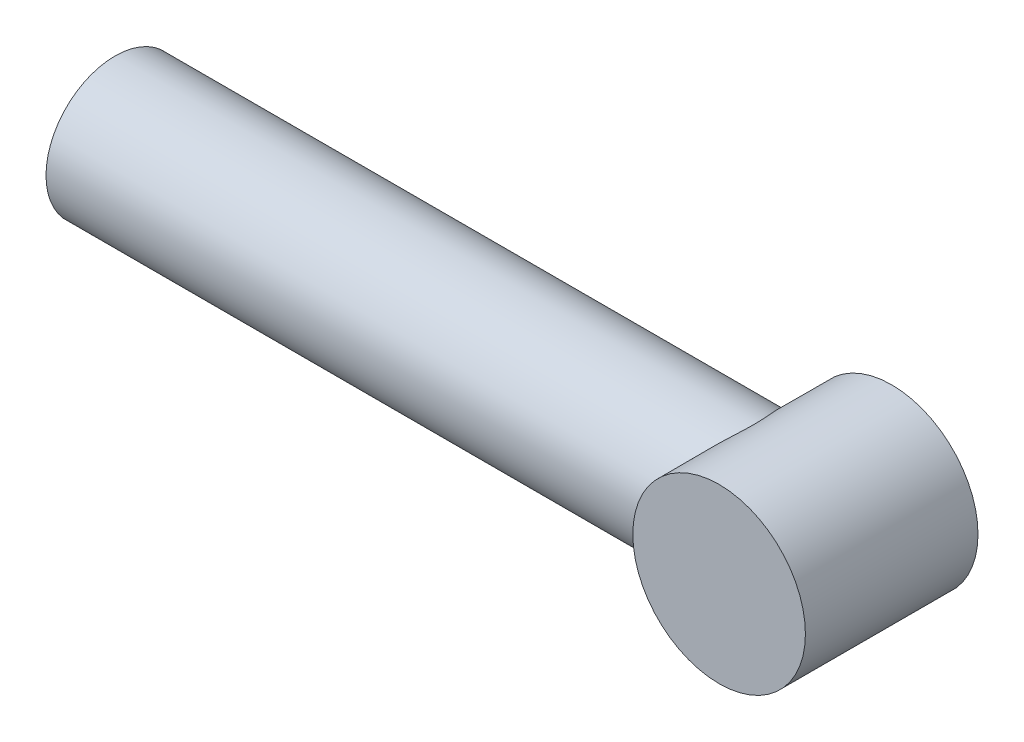
ISO-10303-21;
HEADER;
FILE_DESCRIPTION(('STEP AP214'),'2;1');
FILE_NAME('part.step','',(''),(''),'','','');
FILE_SCHEMA(('AUTOMOTIVE_DESIGN { 1 0 10303 214 1 1 1 1 }'));
ENDSEC;
DATA;
#1=APPLICATION_CONTEXT('core data for automotive mechanical design processes');
#2=APPLICATION_PROTOCOL_DEFINITION('international standard','automotive_design',2000,#1);
#3=PRODUCT_CONTEXT('',#1,'mechanical');
#4=PRODUCT('Part','Part','',(#3));
#5=PRODUCT_RELATED_PRODUCT_CATEGORY('part','',(#4));
#6=PRODUCT_DEFINITION_FORMATION('','',#4);
#7=PRODUCT_DEFINITION_CONTEXT('part definition',#1,'design');
#8=PRODUCT_DEFINITION('design','',#6,#7);
#9=PRODUCT_DEFINITION_SHAPE('','',#8);
#10=(LENGTH_UNIT() NAMED_UNIT(*) SI_UNIT(.MILLI.,.METRE.));
#11=(NAMED_UNIT(*) PLANE_ANGLE_UNIT() SI_UNIT($,.RADIAN.));
#12=(NAMED_UNIT(*) SI_UNIT($,.STERADIAN.) SOLID_ANGLE_UNIT());
#13=UNCERTAINTY_MEASURE_WITH_UNIT(LENGTH_MEASURE(1.E-05),#10,'distance_accuracy_value','');
#14=(GEOMETRIC_REPRESENTATION_CONTEXT(3) GLOBAL_UNCERTAINTY_ASSIGNED_CONTEXT((#13)) GLOBAL_UNIT_ASSIGNED_CONTEXT((#10,
#11,#12)) REPRESENTATION_CONTEXT('',''));
#15=CARTESIAN_POINT('',(0.,0.,0.));
#16=DIRECTION('',(0.,0.,1.));
#17=DIRECTION('',(1.,0.,0.));
#18=AXIS2_PLACEMENT_3D('',#15,#16,#17);
#19=CARTESIAN_POINT('',(200.,0.,0.));
#20=DIRECTION('',(-1.,0.,0.));
#21=DIRECTION('',(0.,0.,1.));
#22=AXIS2_PLACEMENT_3D('',#19,#20,#21);
#23=CYLINDRICAL_SURFACE('',#22,40.);
#24=CARTESIAN_POINT('',(-200.,0.,0.));
#25=DIRECTION('',(1.,0.,0.));
#26=DIRECTION('',(0.,0.,-1.));
#27=AXIS2_PLACEMENT_3D('',#24,#25,#26);
#28=CIRCLE('',#27,40.);
#29=CARTESIAN_POINT('',(-200.,0.,-40.));
#30=VERTEX_POINT('',#29);
#31=EDGE_CURVE('E43',#30,#30,#28,.T.);
#32=ORIENTED_EDGE('',*,*,#31,.T.);
#33=EDGE_LOOP('',(#32));
#34=FACE_BOUND('',#33,.T.);
#35=CARTESIAN_POINT('',(150.,0.,40.));
#36=CARTESIAN_POINT('',(150.000009713421,-0.960337317603065,39.9999899655505));
#37=CARTESIAN_POINT('',(150.027738093411,-1.92103825174153,39.965344130341));
#38=CARTESIAN_POINT('',(150.138036575608,-3.83460710770069,39.8273406683373));
#39=CARTESIAN_POINT('',(150.220635700476,-4.78747061392242,39.7239466787068));
#40=CARTESIAN_POINT('',(150.438963093926,-6.67920680850692,39.4500093404149));
#41=CARTESIAN_POINT('',(150.574792912782,-7.6180491730509,39.2793376397602));
#42=CARTESIAN_POINT('',(150.896514362471,-9.47278784316619,38.8737383716902));
#43=CARTESIAN_POINT('',(151.082400408243,-10.3886866962233,38.6388179728265));
#44=CARTESIAN_POINT('',(151.499010365285,-12.1860448986504,38.1100030483728));
#45=CARTESIAN_POINT('',(151.729439229498,-13.0676873720396,37.8164961975772));
#46=CARTESIAN_POINT('',(152.231519331761,-14.7981074225095,37.1734863365716));
#47=CARTESIAN_POINT('',(152.503170827585,-15.6468847940366,36.8239829762036));
#48=CARTESIAN_POINT('',(153.082928762828,-17.3078631155302,36.0730992030751));
#49=CARTESIAN_POINT('',(153.391026088426,-18.1200731398626,35.6717317573903));
#50=CARTESIAN_POINT('',(154.039000463517,-19.7058441108158,34.8208209286232));
#51=CARTESIAN_POINT('',(154.378884012283,-20.4793971034718,34.3712676903186));
#52=CARTESIAN_POINT('',(154.970397265871,-21.7405090451485,33.5813865490857));
#53=CARTESIAN_POINT('',(155.214721621661,-22.2391661899703,33.2531653527831));
#54=CARTESIAN_POINT('',(155.71404829788,-23.2175821753519,32.5775571715156));
#55=CARTESIAN_POINT('',(155.969048336455,-23.6973450123228,32.2301742772419));
#56=CARTESIAN_POINT('',(156.748143381878,-25.1083888673531,31.1602744893447));
#57=CARTESIAN_POINT('',(157.286249209809,-26.0112478729574,30.4101180866672));
#58=CARTESIAN_POINT('',(158.389203946291,-27.7416200402566,28.8404448127059));
#59=CARTESIAN_POINT('',(158.954120035809,-28.5689268910585,28.0207491560547));
#60=CARTESIAN_POINT('',(160.097228323747,-30.1449198378464,26.3178577666689));
#61=CARTESIAN_POINT('',(160.675419005744,-30.8936148601352,25.4346692627179));
#62=CARTESIAN_POINT('',(161.841235230747,-32.322928156125,23.5925581067076));
#63=CARTESIAN_POINT('',(162.42886684111,-33.0022979067521,22.6326666595117));
#64=CARTESIAN_POINT('',(163.298699586356,-33.9588113294495,21.145835545534));
#65=CARTESIAN_POINT('',(163.586789697094,-34.2673057721559,20.6422403953403));
#66=CARTESIAN_POINT('',(164.156795460499,-34.8630820045459,19.6192733098945));
#67=CARTESIAN_POINT('',(164.438711722438,-35.1503658941105,19.0999029436206));
#68=CARTESIAN_POINT('',(164.993119025265,-35.7025344651925,18.0466515838975));
#69=CARTESIAN_POINT('',(165.265633401255,-35.9674773777477,17.5128134287131));
#70=CARTESIAN_POINT('',(165.79923868526,-36.4752457872218,16.4290760361571));
#71=CARTESIAN_POINT('',(166.060329022893,-36.7180701804527,15.8791759991228));
#72=CARTESIAN_POINT('',(166.567711527861,-37.1806380629351,14.7636195685688));
#73=CARTESIAN_POINT('',(166.81401489761,-37.4003991215583,14.1979755903776));
#74=CARTESIAN_POINT('',(167.288470170828,-37.8160719858136,13.0505560059611));
#75=CARTESIAN_POINT('',(167.516623295865,-38.0119853969403,12.4687814889329));
#76=CARTESIAN_POINT('',(167.983430430793,-38.4063287968087,11.2008152379521));
#77=CARTESIAN_POINT('',(168.218532227984,-38.6007341429587,10.51204347045));
#78=CARTESIAN_POINT('',(168.653015703361,-38.9543981140488,9.11450642112965));
#79=CARTESIAN_POINT('',(168.852403046248,-39.1136623136884,8.4057443306725));
#80=CARTESIAN_POINT('',(169.208376411789,-39.3945089701146,6.97174066571736));
#81=CARTESIAN_POINT('',(169.36505241666,-39.5161707194822,6.24653727800037));
#82=CARTESIAN_POINT('',(169.629842951554,-39.7200407558248,4.78173507298083));
#83=CARTESIAN_POINT('',(169.737958073255,-39.802249523505,4.04213643118804));
#84=CARTESIAN_POINT('',(169.90133192227,-39.9259430521321,2.54689613390493));
#85=CARTESIAN_POINT('',(169.956108748981,-39.9670566128739,1.79117012816373));
#86=CARTESIAN_POINT('',(170.008270075565,-40.0062151100752,0.276633037623785));
#87=CARTESIAN_POINT('',(170.005657407385,-40.0042621716977,-0.482177893098519));
#88=CARTESIAN_POINT('',(169.943160850268,-39.9573259270323,-1.99661799876617));
#89=CARTESIAN_POINT('',(169.88323541198,-39.9123114028992,-2.75224446591342));
#90=CARTESIAN_POINT('',(169.709146200742,-39.7803459798636,-4.25349313675358));
#91=CARTESIAN_POINT('',(169.594974845164,-39.6933892181461,-4.99911392684136));
#92=CARTESIAN_POINT('',(169.296008176701,-39.4627146667173,-6.59074393125148));
#93=CARTESIAN_POINT('',(169.1029604656,-39.3122468772218,-7.43421699833316));
#94=CARTESIAN_POINT('',(168.661660374706,-38.9613603015859,-9.09582896297411));
#95=CARTESIAN_POINT('',(168.413396080961,-38.7609307341793,-9.91396234958124));
#96=CARTESIAN_POINT('',(167.871685925527,-38.3131195376455,-11.5241061197849));
#97=CARTESIAN_POINT('',(167.578129945175,-38.0656231233099,-12.3160469643134));
#98=CARTESIAN_POINT('',(166.956213556036,-37.5270208256944,-13.8708234257715));
#99=CARTESIAN_POINT('',(166.627850365585,-37.2359114562595,-14.6336567098979));
#100=CARTESIAN_POINT('',(166.03194818967,-36.6918302323134,-15.939723098304));
#101=CARTESIAN_POINT('',(165.770184364865,-36.4479938970039,-16.4894565575485));
#102=CARTESIAN_POINT('',(165.235272407108,-35.9381443116079,-17.5729419964088));
#103=CARTESIAN_POINT('',(164.96212313639,-35.6721288424559,-18.106692369607));
#104=CARTESIAN_POINT('',(164.407174210366,-35.1184343896659,-19.1585214005948));
#105=CARTESIAN_POINT('',(164.125371268155,-34.830747112645,-19.6765939513846));
#106=CARTESIAN_POINT('',(163.555730905886,-34.2342731018837,-20.6969491526196));
#107=CARTESIAN_POINT('',(163.267893658131,-33.9254869700272,-21.1992322528916));
#108=CARTESIAN_POINT('',(162.398052086122,-32.9672187050626,-22.6837299484833));
#109=CARTESIAN_POINT('',(161.810265099411,-32.2863649639095,-23.6425733340181));
#110=CARTESIAN_POINT('',(160.635434104939,-30.8431085653317,-25.4967141258071));
#111=CARTESIAN_POINT('',(160.04838999102,-30.080719317879,-26.3920219414511));
#112=CARTESIAN_POINT('',(158.87294522888,-28.453465810621,-28.1400802220676));
#113=CARTESIAN_POINT('',(158.284929547637,-27.5864034467277,-28.9910480559512));
#114=CARTESIAN_POINT('',(157.137422757778,-25.7673359763549,-30.619173293891));
#115=CARTESIAN_POINT('',(156.577935861927,-24.8153183815294,-31.3963198114988));
#116=CARTESIAN_POINT('',(155.771056129462,-23.3263522450451,-32.5001847567502));
#117=CARTESIAN_POINT('',(155.507733313988,-22.8204057830619,-32.857506572597));
#118=CARTESIAN_POINT('',(154.993237673055,-21.7881562398975,-33.5508979727016));
#119=CARTESIAN_POINT('',(154.742064079216,-21.2618544498928,-33.8869689013912));
#120=CARTESIAN_POINT('',(154.253674713914,-20.1896164803325,-34.5365326010554));
#121=CARTESIAN_POINT('',(154.016452058659,-19.6436902020075,-34.8500365246383));
#122=CARTESIAN_POINT('',(153.557460186188,-18.5324581411746,-35.4534605272054));
#123=CARTESIAN_POINT('',(153.33569469413,-17.9671477357558,-35.7433749239427));
#124=CARTESIAN_POINT('',(152.818864727025,-16.5741428935081,-36.4159796166101));
#125=CARTESIAN_POINT('',(152.53262712217,-15.7368978450571,-36.7858371895076));
#126=CARTESIAN_POINT('',(151.999878351874,-14.0281401888326,-37.4707619183103));
#127=CARTESIAN_POINT('',(151.753357326221,-13.1566361533906,-37.7858426748891));
#128=CARTESIAN_POINT('',(151.416793121347,-11.8271364104959,-38.2143395421982));
#129=CARTESIAN_POINT('',(151.310149844974,-11.3803061331231,-38.3498069925522));
#130=CARTESIAN_POINT('',(151.108428258599,-10.4798425549219,-38.6055950227049));
#131=CARTESIAN_POINT('',(151.013347990559,-10.0262104205506,-38.725918167107));
#132=CARTESIAN_POINT('',(150.746165099454,-8.65593274931266,-39.0635293235024));
#133=CARTESIAN_POINT('',(150.592094944512,-7.72980603591299,-39.2574913728039));
#134=CARTESIAN_POINT('',(150.33484077448,-5.85430089988323,-39.5807738677692));
#135=CARTESIAN_POINT('',(150.231929855416,-4.90482549587214,-39.7097474435064));
#136=CARTESIAN_POINT('',(150.080570452958,-2.99469380809515,-39.8992821622338));
#137=CARTESIAN_POINT('',(150.032121878594,-2.03403754300765,-39.9598434194948));
#138=CARTESIAN_POINT('',(149.990861092169,-0.109806201052153,-40.0114260092202));
#139=CARTESIAN_POINT('',(149.99804100758,0.853768443514832,-40.0024571815618));
#140=CARTESIAN_POINT('',(150.067846240705,2.7757092792124,-39.9151684805633));
#141=CARTESIAN_POINT('',(150.130468722916,3.73407573418376,-39.8368521538656));
#142=CARTESIAN_POINT('',(150.302366907066,5.56031714729821,-39.6214404340059));
#143=CARTESIAN_POINT('',(150.407442520729,6.42922228763287,-39.4896329529416));
#144=CARTESIAN_POINT('',(150.661073901886,8.15026869061224,-39.1706393757356));
#145=CARTESIAN_POINT('',(150.80962685544,9.00241103437018,-38.9834568635668));
#146=CARTESIAN_POINT('',(151.147532809455,10.685185547352,-38.5562009958302));
#147=CARTESIAN_POINT('',(151.336893796815,11.5158134700989,-38.3161172862959));
#148=CARTESIAN_POINT('',(151.753178916234,13.1512899928912,-37.7860115062731));
#149=CARTESIAN_POINT('',(151.980105127244,13.9561371632225,-37.4959866718843));
#150=CARTESIAN_POINT('',(152.483031422219,15.58553393233,-36.8497760072204));
#151=CARTESIAN_POINT('',(152.761196571962,16.4082310798128,-36.4906105635653));
#152=CARTESIAN_POINT('',(153.351374173275,18.0177856508563,-35.7233034147602));
#153=CARTESIAN_POINT('',(153.663387627406,18.8046420118585,-35.3151602588883));
#154=CARTESIAN_POINT('',(154.316618484345,20.3402264231708,-34.4535954645144));
#155=CARTESIAN_POINT('',(154.657831031472,21.0889607800987,-34.000181352289));
#156=CARTESIAN_POINT('',(155.365009194038,22.547156358329,-33.0512114826342));
#157=CARTESIAN_POINT('',(155.730978507768,23.2566116830179,-32.5556494260746));
#158=CARTESIAN_POINT('',(156.330595256086,24.3557219690513,-31.7342195200155));
#159=CARTESIAN_POINT('',(156.557760090292,24.7584580160788,-31.4209733975836));
#160=CARTESIAN_POINT('',(157.01820508667,25.5494559230754,-30.78122748881));
#161=CARTESIAN_POINT('',(157.251483819309,25.9377211160471,-30.4547307910537));
#162=CARTESIAN_POINT('',(157.959241403694,27.0809500209275,-29.4558421711984));
#163=CARTESIAN_POINT('',(158.441614246961,27.8142972392493,-28.7640890541843));
#164=CARTESIAN_POINT('',(159.420791354452,29.2244228834484,-27.3303350541018));
#165=CARTESIAN_POINT('',(159.91763150542,29.9010409793003,-26.5882018190992));
#166=CARTESIAN_POINT('',(160.916447265573,31.1952511829746,-25.0571569661297));
#167=CARTESIAN_POINT('',(161.418423210905,31.8128393994679,-24.2682422698134));
#168=CARTESIAN_POINT('',(162.221776377332,32.7570649064664,-22.963979946549));
#169=CARTESIAN_POINT('',(162.524437406622,33.1026381609827,-22.4630065075668));
#170=CARTESIAN_POINT('',(163.126031257113,33.7714763386967,-21.4443141791751));
#171=CARTESIAN_POINT('',(163.424964694939,34.0947449927636,-20.9265981116709));
#172=CARTESIAN_POINT('',(164.016876287504,34.7188696490502,-19.8739710030736));
#173=CARTESIAN_POINT('',(164.309850590662,35.0197114710879,-19.3390493839981));
#174=CARTESIAN_POINT('',(164.886919086001,35.5982931437609,-18.2521387352772));
#175=CARTESIAN_POINT('',(165.171012999604,35.876032270115,-17.7001491712869));
#176=CARTESIAN_POINT('',(165.726241652606,36.4068189966516,-16.5808866575559));
#177=CARTESIAN_POINT('',(165.997418305232,36.659949690076,-16.0136740248487));
#178=CARTESIAN_POINT('',(166.524420031174,37.1417962141712,-14.8619199206453));
#179=CARTESIAN_POINT('',(166.780244268005,37.37051071504,-14.277377507514));
#180=CARTESIAN_POINT('',(167.272344997004,37.8022171685462,-13.091600973481));
#181=CARTESIAN_POINT('',(167.508642619088,38.0052370554788,-12.4903858610512));
#182=CARTESIAN_POINT('',(167.957631372883,38.3845411057123,-11.2709649526988));
#183=CARTESIAN_POINT('',(168.170325055955,38.5608281593336,-10.6527610021372));
#184=CARTESIAN_POINT('',(168.58257203191,38.897575926953,-9.35218977975284));
#185=CARTESIAN_POINT('',(168.779886253723,39.0558044682243,-8.66852466279375));
#186=CARTESIAN_POINT('',(169.135595848407,39.3375156387851,-7.28413538690891));
#187=CARTESIAN_POINT('',(169.293997985898,39.4610043079249,-6.58341421638277));
#188=CARTESIAN_POINT('',(169.565772538329,39.6709888377274,-5.16935839309226));
#189=CARTESIAN_POINT('',(169.679243907126,39.757566023523,-4.45605511360454));
#190=CARTESIAN_POINT('',(169.856830603471,39.8923788269256,-3.01965791766803));
#191=CARTESIAN_POINT('',(169.920946260694,39.9406147006359,-2.29656406664884));
#192=CARTESIAN_POINT('',(169.997017695863,39.9977924999235,-0.842077194983811));
#193=CARTESIAN_POINT('',(170.008686888131,40.0065185319396,-0.110660418364678));
#194=CARTESIAN_POINT('',(169.978506300971,39.9838747579982,1.35041092533592));
#195=CARTESIAN_POINT('',(169.936657450851,39.9525056482675,2.08006552279609));
#196=CARTESIAN_POINT('',(169.801384373207,39.850353927955,3.53274167534831));
#197=CARTESIAN_POINT('',(169.707889452015,39.7795172926711,4.25575275456557));
#198=CARTESIAN_POINT('',(169.473504678449,39.5999333237637,5.6892369354008));
#199=CARTESIAN_POINT('',(169.332607502825,39.4911801322553,6.39970808184355));
#200=CARTESIAN_POINT('',(168.964615492094,39.2029776592161,7.99708822347029));
#201=CARTESIAN_POINT('',(168.724479257589,39.0123208743918,8.87897247143851));
#202=CARTESIAN_POINT('',(168.189073036264,38.5769832571289,10.6120481513389));
#203=CARTESIAN_POINT('',(167.893784895929,38.3322846317051,11.4632293668374));
#204=CARTESIAN_POINT('',(167.259695048441,37.7921453327399,13.1349650275383));
#205=CARTESIAN_POINT('',(166.920790088327,37.4965836739564,13.95544063569));
#206=CARTESIAN_POINT('',(166.210968153998,36.8582295147521,15.5633966668762));
#207=CARTESIAN_POINT('',(165.840049918162,36.5154351526028,16.3508757877219));
#208=CARTESIAN_POINT('',(165.179902195069,35.8846591043814,17.6826467099844));
#209=CARTESIAN_POINT('',(164.896004436015,35.6072491818316,18.2346562511275));
#210=CARTESIAN_POINT('',(164.319253855908,35.0292876905311,19.3216968557099));
#211=CARTESIAN_POINT('',(164.026400257048,34.7287341083094,19.8567264361816));
#212=CARTESIAN_POINT('',(163.434418441058,34.104885410554,20.9100838876258));
#213=CARTESIAN_POINT('',(163.135288083771,33.7815824468452,21.4284059039466));
#214=CARTESIAN_POINT('',(162.53333139218,33.1127063182206,22.4481724792795));
#215=CARTESIAN_POINT('',(162.230505151047,32.7671337137693,22.9496174625561));
#216=CARTESIAN_POINT('',(161.319274497402,31.6966775337519,24.4295880724518));
#217=CARTESIAN_POINT('',(160.708568270348,30.9385234165528,25.3829607031962));
#218=CARTESIAN_POINT('',(159.497449550543,29.3351889955648,27.2200771578111));
#219=CARTESIAN_POINT('',(158.897035448126,28.4900224478867,28.1038319489423));
#220=CARTESIAN_POINT('',(157.712898273737,26.7014356696774,29.8090613790159));
#221=CARTESIAN_POINT('',(157.129500980357,25.7568637916352,30.6295577229048));
#222=CARTESIAN_POINT('',(156.0020340963,23.7796863680122,32.1886736909573));
#223=CARTESIAN_POINT('',(155.457971038811,22.7470662599228,32.9272797244364));
#224=CARTESIAN_POINT('',(154.683092929137,21.1360479259286,33.9657874678806));
#225=CARTESIAN_POINT('',(154.431902754651,20.5892776142864,34.300086907713));
#226=CARTESIAN_POINT('',(153.944759855982,19.4752209561246,34.9446670765635));
#227=CARTESIAN_POINT('',(153.708804725752,18.9079378713406,35.254951599766));
#228=CARTESIAN_POINT('',(153.254014870765,17.7538005313285,35.8500196571099));
#229=CARTESIAN_POINT('',(153.035172977207,17.1669546195832,36.1348138765464));
#230=CARTESIAN_POINT('',(152.616315256413,15.9745348982222,36.6775591965356));
#231=CARTESIAN_POINT('',(152.416297086702,15.3689634313584,36.9355136375252));
#232=CARTESIAN_POINT('',(151.971093666301,13.9274237415026,37.507578036524));
#233=CARTESIAN_POINT('',(151.734240067837,13.084263340767,37.8102180458277));
#234=CARTESIAN_POINT('',(151.301885738625,11.369920378681,38.360595909525));
#235=CARTESIAN_POINT('',(151.106381922597,10.4987399136155,38.6083378601558));
#236=CARTESIAN_POINT('',(150.760745656136,8.73506769004315,39.0451272892425));
#237=CARTESIAN_POINT('',(150.610511603389,7.84262857965284,39.2343062315347));
#238=CARTESIAN_POINT('',(150.357903118004,6.04063896159295,39.5518275913771));
#239=CARTESIAN_POINT('',(150.255507381222,5.13109625886363,39.6801970899428));
#240=CARTESIAN_POINT('',(150.118972337891,3.5177614432962,39.8512087980055));
#241=CARTESIAN_POINT('',(150.074414914397,2.81621264179269,39.9069489166212));
#242=CARTESIAN_POINT('',(150.029798974355,1.76151114851001,39.9627464265366));
#243=CARTESIAN_POINT('',(150.018630353836,1.40950530367482,39.976710157916));
#244=CARTESIAN_POINT('',(150.003728147944,0.705016037755384,39.9953399567366));
#245=CARTESIAN_POINT('',(149.999996434277,0.35253251878188,40.00000368357));
#246=CARTESIAN_POINT('',(150.,0.,40.));
#247=B_SPLINE_CURVE_WITH_KNOTS('',3,(#35,#36,#37,#38,#39,#40,#41,#42,#43,#44,#45,#46,#47,#48,
#49,#50,#51,#52,#53,#54,#55,#56,#57,#58,#59,#60,#61,#62,#63,#64,#65,#66,#67,#68,#69,#70,#71,#72,
#73,#74,#75,#76,#77,#78,#79,#80,#81,#82,#83,#84,#85,#86,#87,#88,#89,#90,#91,#92,#93,#94,#95,#96,
#97,#98,#99,#100,#101,#102,#103,#104,#105,#106,#107,#108,#109,#110,#111,#112,#113,#114,#115,
#116,#117,#118,#119,#120,#121,#122,#123,#124,#125,#126,#127,#128,#129,#130,#131,#132,#133,#134,
#135,#136,#137,#138,#139,#140,#141,#142,#143,#144,#145,#146,#147,#148,#149,#150,#151,#152,#153,
#154,#155,#156,#157,#158,#159,#160,#161,#162,#163,#164,#165,#166,#167,#168,#169,#170,#171,#172,
#173,#174,#175,#176,#177,#178,#179,#180,#181,#182,#183,#184,#185,#186,#187,#188,#189,#190,#191,
#192,#193,#194,#195,#196,#197,#198,#199,#200,#201,#202,#203,#204,#205,#206,#207,#208,#209,#210,
#211,#212,#213,#214,#215,#216,#217,#218,#219,#220,#221,#222,#223,#224,#225,#226,#227,#228,#229,
#230,#231,#232,#233,#234,#235,#236,#237,#238,#239,#240,#241,#242,#243,#244,#245,#246),
.UNSPECIFIED.,.T.,.F.,(4,2,2,2,2,2,2,2,2,2,2,2,2,2,2,2,2,2,2,2,2,2,2,2,2,2,2,2,2,2,2,2,2,2,2,2,
2,2,2,2,2,2,2,2,2,2,2,2,2,2,2,2,2,2,2,2,2,2,2,2,2,2,2,2,2,2,2,2,2,2,2,2,2,2,2,2,2,2,2,2,2,2,2,2,
2,2,2,2,2,2,2,2,2,2,2,2,2,2,2,2,2,2,2,2,2,4),(0.,2.88062758615679,5.76278003074698,
8.65045784797841,11.5378136037629,14.4066614925712,17.2755273215981,20.1436772586725,
23.0124149288824,24.9469208273241,26.8810153286382,30.749879343647,34.6290105291467,
38.507700765339,42.4470818946003,44.4179128084292,46.3885483442504,48.3538775799512,
50.3193048295859,52.2832238029098,54.2470104861715,56.505158357952,58.7629477451065,
61.0159431092657,63.268911021651,65.5420502165159,67.8150772411175,70.0897533648501,
72.3647475419903,74.9955216323603,77.6268639103998,80.2647076887451,82.9027624329285,
84.8697610369223,86.8369566796517,88.8049089923121,90.7728051889146,94.7124150123824,
98.6513778901095,102.695863563299,106.740944754875,108.759483006771,110.777893428343,
112.795299404486,114.813189903704,117.687325407657,120.560746262904,121.997183290601,
123.433376737503,126.305440568867,129.19267556847,132.079905745442,134.9667273299,
137.853401282022,140.505730689314,143.157888470558,145.810565801165,148.463389986564,
151.280030848168,154.096755159395,156.913011968713,159.729690417735,161.404844892208,
163.079611121496,166.429347142809,169.788251812516,173.147377753238,175.18598961902,
177.224259657292,179.263807723302,181.303419706099,183.335886303556,185.368463540742,
187.398811693755,189.428940171327,191.613888302885,193.798456325765,195.978186014466,
198.157901143391,200.349512624176,202.541086049539,204.735666783287,206.930586717202,
209.727217531656,212.524770498097,215.329072235659,218.133484539455,220.172557144903,
222.211807348122,224.251764542407,226.291670416716,230.374537434967,234.456759966271,
238.592973263586,242.72987199107,244.794153116108,246.85810743095,248.921192463368,
250.98402041954,253.760898388863,256.537569090672,259.307960673146,262.07711732055,
264.190991665153,265.248182085266,266.305638543539),.UNSPECIFIED.);
#248=CARTESIAN_POINT('',(150.,0.,40.));
#249=VERTEX_POINT('',#248);
#250=EDGE_CURVE('E10',#249,#249,#247,.T.);
#251=ORIENTED_EDGE('',*,*,#250,.F.);
#252=EDGE_LOOP('',(#251));
#253=FACE_BOUND('',#252,.T.);
#254=ADVANCED_FACE('F32',(#34,#253),#23,.T.);
#255=CARTESIAN_POINT('',(-200.,0.,0.));
#256=DIRECTION('',(1.,0.,0.));
#257=DIRECTION('',(0.,0.,-1.));
#258=AXIS2_PLACEMENT_3D('',#255,#256,#257);
#259=PLANE('',#258);
#260=ORIENTED_EDGE('',*,*,#31,.F.);
#261=EDGE_LOOP('',(#260));
#262=FACE_BOUND('',#261,.T.);
#263=ADVANCED_FACE('F70',(#262),#259,.F.);
#264=CARTESIAN_POINT('',(200.,0.,50.));
#265=DIRECTION('',(0.,0.,-1.));
#266=DIRECTION('',(-1.,0.,0.));
#267=AXIS2_PLACEMENT_3D('',#264,#265,#266);
#268=CYLINDRICAL_SURFACE('',#267,50.);
#269=CARTESIAN_POINT('',(200.,0.,-50.));
#270=DIRECTION('',(0.,0.,1.));
#271=DIRECTION('',(1.,0.,0.));
#272=AXIS2_PLACEMENT_3D('',#269,#270,#271);
#273=CIRCLE('',#272,50.);
#274=CARTESIAN_POINT('',(250.,0.,-50.));
#275=VERTEX_POINT('',#274);
#276=EDGE_CURVE('E51',#275,#275,#273,.T.);
#277=ORIENTED_EDGE('',*,*,#276,.T.);
#278=EDGE_LOOP('',(#277));
#279=FACE_BOUND('',#278,.T.);
#280=CARTESIAN_POINT('',(200.,0.,50.));
#281=DIRECTION('',(0.,0.,1.));
#282=DIRECTION('',(1.,0.,0.));
#283=AXIS2_PLACEMENT_3D('',#280,#281,#282);
#284=CIRCLE('',#283,50.);
#285=CARTESIAN_POINT('',(250.,0.,50.));
#286=VERTEX_POINT('',#285);
#287=EDGE_CURVE('E47',#286,#286,#284,.T.);
#288=ORIENTED_EDGE('',*,*,#287,.F.);
#289=EDGE_LOOP('',(#288));
#290=FACE_BOUND('',#289,.T.);
#291=ORIENTED_EDGE('',*,*,#250,.T.);
#292=EDGE_LOOP('',(#291));
#293=FACE_BOUND('',#292,.T.);
#294=ADVANCED_FACE('F57',(#279,#290,#293),#268,.T.);
#295=CARTESIAN_POINT('',(200.,0.,50.));
#296=DIRECTION('',(0.,0.,1.));
#297=DIRECTION('',(1.,0.,0.));
#298=AXIS2_PLACEMENT_3D('',#295,#296,#297);
#299=PLANE('',#298);
#300=ORIENTED_EDGE('',*,*,#287,.T.);
#301=EDGE_LOOP('',(#300));
#302=FACE_BOUND('',#301,.T.);
#303=ADVANCED_FACE('F62',(#302),#299,.T.);
#304=CARTESIAN_POINT('',(200.,0.,-50.));
#305=DIRECTION('',(0.,0.,1.));
#306=DIRECTION('',(1.,0.,0.));
#307=AXIS2_PLACEMENT_3D('',#304,#305,#306);
#308=PLANE('',#307);
#309=ORIENTED_EDGE('',*,*,#276,.F.);
#310=EDGE_LOOP('',(#309));
#311=FACE_BOUND('',#310,.T.);
#312=ADVANCED_FACE('F60',(#311),#308,.F.);
#313=CLOSED_SHELL('',(#254,#263,#294,#303,#312));
#314=MANIFOLD_SOLID_BREP('B2',#313);
#315=ADVANCED_BREP_SHAPE_REPRESENTATION('',(#18,#314),#14);
#316=SHAPE_DEFINITION_REPRESENTATION(#9,#315);
ENDSEC;
END-ISO-10303-21;
